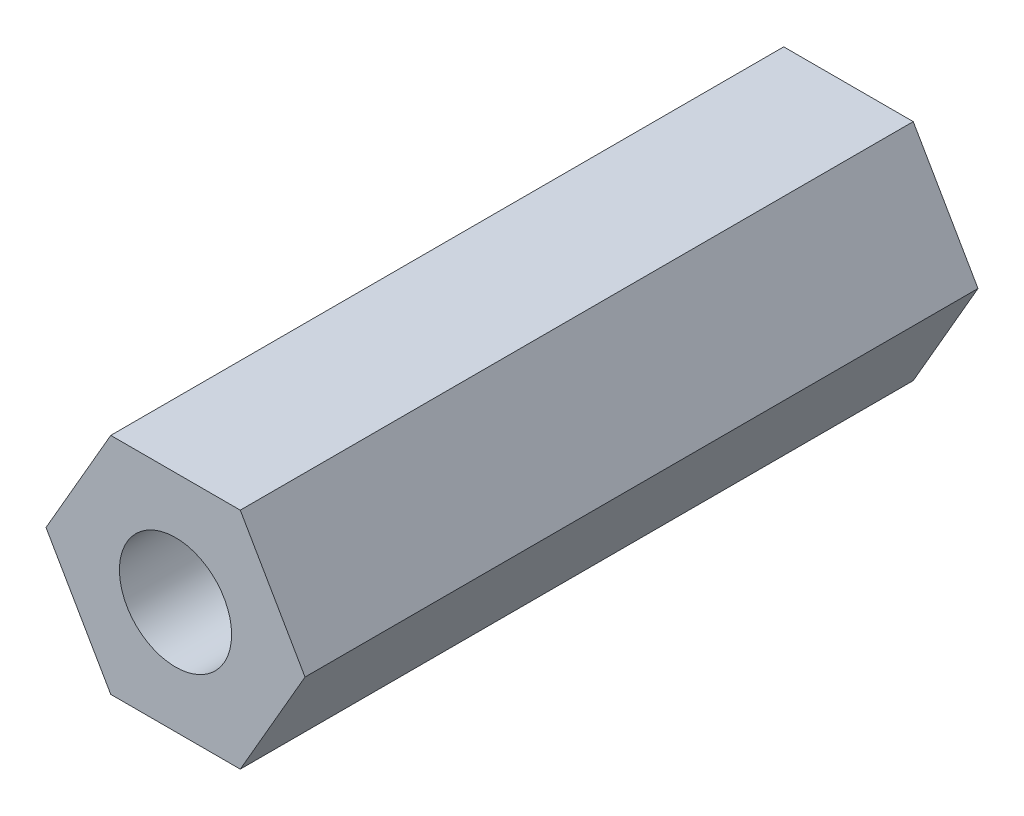
ISO-10303-21;
HEADER;
FILE_DESCRIPTION(('STEP AP214'),'2;1');
FILE_NAME('part.step','',(''),(''),'','','');
FILE_SCHEMA(('AUTOMOTIVE_DESIGN { 1 0 10303 214 1 1 1 1 }'));
ENDSEC;
DATA;
#1=APPLICATION_CONTEXT('core data for automotive mechanical design processes');
#2=APPLICATION_PROTOCOL_DEFINITION('international standard','automotive_design',2000,#1);
#3=PRODUCT_CONTEXT('',#1,'mechanical');
#4=PRODUCT('Part','Part','',(#3));
#5=PRODUCT_RELATED_PRODUCT_CATEGORY('part','',(#4));
#6=PRODUCT_DEFINITION_FORMATION('','',#4);
#7=PRODUCT_DEFINITION_CONTEXT('part definition',#1,'design');
#8=PRODUCT_DEFINITION('design','',#6,#7);
#9=PRODUCT_DEFINITION_SHAPE('','',#8);
#10=(LENGTH_UNIT() NAMED_UNIT(*) SI_UNIT(.MILLI.,.METRE.));
#11=(NAMED_UNIT(*) PLANE_ANGLE_UNIT() SI_UNIT($,.RADIAN.));
#12=(NAMED_UNIT(*) SI_UNIT($,.STERADIAN.) SOLID_ANGLE_UNIT());
#13=UNCERTAINTY_MEASURE_WITH_UNIT(LENGTH_MEASURE(1.E-05),#10,'distance_accuracy_value','');
#14=(GEOMETRIC_REPRESENTATION_CONTEXT(3) GLOBAL_UNCERTAINTY_ASSIGNED_CONTEXT((#13)) GLOBAL_UNIT_ASSIGNED_CONTEXT((#10,
#11,#12)) REPRESENTATION_CONTEXT('',''));
#15=CARTESIAN_POINT('',(0.,0.,0.));
#16=DIRECTION('',(0.,0.,1.));
#17=DIRECTION('',(1.,0.,0.));
#18=AXIS2_PLACEMENT_3D('',#15,#16,#17);
#19=CARTESIAN_POINT('',(2.88675134594813,0.,15.));
#20=DIRECTION('',(-0.866025403784439,-0.5,0.));
#21=DIRECTION('',(0.5,-0.866025403784439,0.));
#22=AXIS2_PLACEMENT_3D('',#19,#20,#21);
#23=PLANE('',#22);
#24=DIRECTION('',(-0.5,0.866025403784439,0.));
#25=VECTOR('',#24,1.);
#26=CARTESIAN_POINT('',(2.88675134594813,0.,0.));
#27=LINE('',#26,#25);
#28=CARTESIAN_POINT('',(2.88675134594813,0.,0.));
#29=VERTEX_POINT('',#28);
#30=CARTESIAN_POINT('',(1.44337567297406,2.5,0.));
#31=VERTEX_POINT('',#30);
#32=EDGE_CURVE('E125',#29,#31,#27,.T.);
#33=ORIENTED_EDGE('',*,*,#32,.T.);
#34=DIRECTION('',(0.,0.,-1.));
#35=VECTOR('',#34,1.);
#36=CARTESIAN_POINT('',(1.44337567297406,2.5,15.));
#37=LINE('',#36,#35);
#38=CARTESIAN_POINT('',(1.44337567297406,2.5,15.));
#39=VERTEX_POINT('',#38);
#40=EDGE_CURVE('E11',#39,#31,#37,.T.);
#41=ORIENTED_EDGE('',*,*,#40,.F.);
#42=DIRECTION('',(-0.5,0.866025403784439,0.));
#43=VECTOR('',#42,1.);
#44=CARTESIAN_POINT('',(2.88675134594813,0.,15.));
#45=LINE('',#44,#43);
#46=CARTESIAN_POINT('',(2.88675134594813,0.,15.));
#47=VERTEX_POINT('',#46);
#48=EDGE_CURVE('E136',#47,#39,#45,.T.);
#49=ORIENTED_EDGE('',*,*,#48,.F.);
#50=DIRECTION('',(0.,0.,-1.));
#51=VECTOR('',#50,1.);
#52=CARTESIAN_POINT('',(2.88675134594813,0.,15.));
#53=LINE('',#52,#51);
#54=EDGE_CURVE('E121',#47,#29,#53,.T.);
#55=ORIENTED_EDGE('',*,*,#54,.T.);
#56=EDGE_LOOP('',(#33,#41,#49,#55));
#57=FACE_BOUND('',#56,.T.);
#58=ADVANCED_FACE('F41',(#57),#23,.F.);
#59=CARTESIAN_POINT('',(1.44337567297406,2.5,15.));
#60=DIRECTION('',(0.,-1.,0.));
#61=DIRECTION('',(0.,0.,-1.));
#62=AXIS2_PLACEMENT_3D('',#59,#60,#61);
#63=PLANE('',#62);
#64=DIRECTION('',(-1.,0.,0.));
#65=VECTOR('',#64,1.);
#66=CARTESIAN_POINT('',(1.44337567297406,2.5,0.));
#67=LINE('',#66,#65);
#68=CARTESIAN_POINT('',(-1.44337567297406,2.5,0.));
#69=VERTEX_POINT('',#68);
#70=EDGE_CURVE('E128',#31,#69,#67,.T.);
#71=ORIENTED_EDGE('',*,*,#70,.T.);
#72=DIRECTION('',(0.,0.,-1.));
#73=VECTOR('',#72,1.);
#74=CARTESIAN_POINT('',(-1.44337567297406,2.5,15.));
#75=LINE('',#74,#73);
#76=CARTESIAN_POINT('',(-1.44337567297406,2.5,15.));
#77=VERTEX_POINT('',#76);
#78=EDGE_CURVE('E49',#77,#69,#75,.T.);
#79=ORIENTED_EDGE('',*,*,#78,.F.);
#80=DIRECTION('',(-1.,0.,0.));
#81=VECTOR('',#80,1.);
#82=CARTESIAN_POINT('',(1.44337567297406,2.5,15.));
#83=LINE('',#82,#81);
#84=EDGE_CURVE('E94',#39,#77,#83,.T.);
#85=ORIENTED_EDGE('',*,*,#84,.F.);
#86=ORIENTED_EDGE('',*,*,#40,.T.);
#87=EDGE_LOOP('',(#71,#79,#85,#86));
#88=FACE_BOUND('',#87,.T.);
#89=ADVANCED_FACE('F161',(#88),#63,.F.);
#90=CARTESIAN_POINT('',(-1.44337567297406,2.5,15.));
#91=DIRECTION('',(0.866025403784439,-0.499999999999999,0.));
#92=DIRECTION('',(0.499999999999999,0.866025403784439,0.));
#93=AXIS2_PLACEMENT_3D('',#90,#91,#92);
#94=PLANE('',#93);
#95=DIRECTION('',(-0.499999999999999,-0.866025403784439,0.));
#96=VECTOR('',#95,1.);
#97=CARTESIAN_POINT('',(-1.44337567297406,2.5,0.));
#98=LINE('',#97,#96);
#99=CARTESIAN_POINT('',(-2.88675134594813,0.,0.));
#100=VERTEX_POINT('',#99);
#101=EDGE_CURVE('E131',#69,#100,#98,.T.);
#102=ORIENTED_EDGE('',*,*,#101,.T.);
#103=DIRECTION('',(0.,0.,-1.));
#104=VECTOR('',#103,1.);
#105=CARTESIAN_POINT('',(-2.88675134594813,0.,15.));
#106=LINE('',#105,#104);
#107=CARTESIAN_POINT('',(-2.88675134594813,0.,15.));
#108=VERTEX_POINT('',#107);
#109=EDGE_CURVE('E116',#108,#100,#106,.T.);
#110=ORIENTED_EDGE('',*,*,#109,.F.);
#111=DIRECTION('',(-0.499999999999999,-0.866025403784439,0.));
#112=VECTOR('',#111,1.);
#113=CARTESIAN_POINT('',(-1.44337567297406,2.5,15.));
#114=LINE('',#113,#112);
#115=EDGE_CURVE('E107',#77,#108,#114,.T.);
#116=ORIENTED_EDGE('',*,*,#115,.F.);
#117=ORIENTED_EDGE('',*,*,#78,.T.);
#118=EDGE_LOOP('',(#102,#110,#116,#117));
#119=FACE_BOUND('',#118,.T.);
#120=ADVANCED_FACE('F142',(#119),#94,.F.);
#121=CARTESIAN_POINT('',(-2.88675134594813,0.,15.));
#122=DIRECTION('',(0.866025403784438,0.5,0.));
#123=DIRECTION('',(-0.5,0.866025403784439,0.));
#124=AXIS2_PLACEMENT_3D('',#121,#122,#123);
#125=PLANE('',#124);
#126=DIRECTION('',(0.5,-0.866025403784438,0.));
#127=VECTOR('',#126,1.);
#128=CARTESIAN_POINT('',(-2.88675134594813,0.,0.));
#129=LINE('',#128,#127);
#130=CARTESIAN_POINT('',(-1.44337567297406,-2.5,0.));
#131=VERTEX_POINT('',#130);
#132=EDGE_CURVE('E115',#100,#131,#129,.T.);
#133=ORIENTED_EDGE('',*,*,#132,.T.);
#134=DIRECTION('',(0.,0.,-1.));
#135=VECTOR('',#134,1.);
#136=CARTESIAN_POINT('',(-1.44337567297406,-2.5,15.));
#137=LINE('',#136,#135);
#138=CARTESIAN_POINT('',(-1.44337567297406,-2.5,15.));
#139=VERTEX_POINT('',#138);
#140=EDGE_CURVE('E112',#139,#131,#137,.T.);
#141=ORIENTED_EDGE('',*,*,#140,.F.);
#142=DIRECTION('',(0.5,-0.866025403784438,0.));
#143=VECTOR('',#142,1.);
#144=CARTESIAN_POINT('',(-2.88675134594813,0.,15.));
#145=LINE('',#144,#143);
#146=EDGE_CURVE('E101',#108,#139,#145,.T.);
#147=ORIENTED_EDGE('',*,*,#146,.F.);
#148=ORIENTED_EDGE('',*,*,#109,.T.);
#149=EDGE_LOOP('',(#133,#141,#147,#148));
#150=FACE_BOUND('',#149,.T.);
#151=ADVANCED_FACE('F113',(#150),#125,.F.);
#152=CARTESIAN_POINT('',(-1.44337567297406,-2.5,15.));
#153=DIRECTION('',(0.,1.,0.));
#154=DIRECTION('',(-1.,0.,0.));
#155=AXIS2_PLACEMENT_3D('',#152,#153,#154);
#156=PLANE('',#155);
#157=DIRECTION('',(1.,0.,0.));
#158=VECTOR('',#157,1.);
#159=CARTESIAN_POINT('',(-1.44337567297406,-2.5,0.));
#160=LINE('',#159,#158);
#161=CARTESIAN_POINT('',(1.44337567297407,-2.5,0.));
#162=VERTEX_POINT('',#161);
#163=EDGE_CURVE('E80',#131,#162,#160,.T.);
#164=ORIENTED_EDGE('',*,*,#163,.T.);
#165=DIRECTION('',(0.,0.,-1.));
#166=VECTOR('',#165,1.);
#167=CARTESIAN_POINT('',(1.44337567297407,-2.5,15.));
#168=LINE('',#167,#166);
#169=CARTESIAN_POINT('',(1.44337567297407,-2.5,15.));
#170=VERTEX_POINT('',#169);
#171=EDGE_CURVE('E117',#170,#162,#168,.T.);
#172=ORIENTED_EDGE('',*,*,#171,.F.);
#173=DIRECTION('',(1.,0.,0.));
#174=VECTOR('',#173,1.);
#175=CARTESIAN_POINT('',(-1.44337567297406,-2.5,15.));
#176=LINE('',#175,#174);
#177=EDGE_CURVE('E105',#139,#170,#176,.T.);
#178=ORIENTED_EDGE('',*,*,#177,.F.);
#179=ORIENTED_EDGE('',*,*,#140,.T.);
#180=EDGE_LOOP('',(#164,#172,#178,#179));
#181=FACE_BOUND('',#180,.T.);
#182=ADVANCED_FACE('F119',(#181),#156,.F.);
#183=CARTESIAN_POINT('',(1.44337567297407,-2.5,15.));
#184=DIRECTION('',(-0.866025403784439,0.5,0.));
#185=DIRECTION('',(-0.5,-0.866025403784439,0.));
#186=AXIS2_PLACEMENT_3D('',#183,#184,#185);
#187=PLANE('',#186);
#188=DIRECTION('',(0.5,0.866025403784439,0.));
#189=VECTOR('',#188,1.);
#190=CARTESIAN_POINT('',(1.44337567297407,-2.5,0.));
#191=LINE('',#190,#189);
#192=EDGE_CURVE('E86',#162,#29,#191,.T.);
#193=ORIENTED_EDGE('',*,*,#192,.T.);
#194=ORIENTED_EDGE('',*,*,#54,.F.);
#195=DIRECTION('',(0.5,0.866025403784439,0.));
#196=VECTOR('',#195,1.);
#197=CARTESIAN_POINT('',(1.44337567297407,-2.5,15.));
#198=LINE('',#197,#196);
#199=EDGE_CURVE('E57',#170,#47,#198,.T.);
#200=ORIENTED_EDGE('',*,*,#199,.F.);
#201=ORIENTED_EDGE('',*,*,#171,.T.);
#202=EDGE_LOOP('',(#193,#194,#200,#201));
#203=FACE_BOUND('',#202,.T.);
#204=ADVANCED_FACE('F149',(#203),#187,.F.);
#205=CARTESIAN_POINT('',(0.,0.,15.));
#206=DIRECTION('',(0.,0.,1.));
#207=DIRECTION('',(1.,0.,0.));
#208=AXIS2_PLACEMENT_3D('',#205,#206,#207);
#209=PLANE('',#208);
#210=CARTESIAN_POINT('',(0.,0.,15.));
#211=DIRECTION('',(0.,0.,1.));
#212=DIRECTION('',(1.,0.,0.));
#213=AXIS2_PLACEMENT_3D('',#210,#211,#212);
#214=CIRCLE('',#213,1.25);
#215=CARTESIAN_POINT('',(1.25,0.,15.));
#216=VERTEX_POINT('',#215);
#217=EDGE_CURVE('E218',#216,#216,#214,.T.);
#218=ORIENTED_EDGE('',*,*,#217,.F.);
#219=EDGE_LOOP('',(#218));
#220=FACE_BOUND('',#219,.T.);
#221=ORIENTED_EDGE('',*,*,#48,.T.);
#222=ORIENTED_EDGE('',*,*,#84,.T.);
#223=ORIENTED_EDGE('',*,*,#115,.T.);
#224=ORIENTED_EDGE('',*,*,#146,.T.);
#225=ORIENTED_EDGE('',*,*,#177,.T.);
#226=ORIENTED_EDGE('',*,*,#199,.T.);
#227=EDGE_LOOP('',(#221,#222,#223,#224,#225,#226));
#228=FACE_BOUND('',#227,.T.);
#229=ADVANCED_FACE('F103',(#220,#228),#209,.T.);
#230=CARTESIAN_POINT('',(0.,0.,0.));
#231=DIRECTION('',(0.,0.,1.));
#232=DIRECTION('',(1.,0.,0.));
#233=AXIS2_PLACEMENT_3D('',#230,#231,#232);
#234=PLANE('',#233);
#235=CARTESIAN_POINT('',(0.,0.,0.));
#236=DIRECTION('',(0.,0.,1.));
#237=DIRECTION('',(1.,0.,0.));
#238=AXIS2_PLACEMENT_3D('',#235,#236,#237);
#239=CIRCLE('',#238,1.25);
#240=CARTESIAN_POINT('',(1.25,0.,0.));
#241=VERTEX_POINT('',#240);
#242=EDGE_CURVE('E129',#241,#241,#239,.T.);
#243=ORIENTED_EDGE('',*,*,#242,.T.);
#244=EDGE_LOOP('',(#243));
#245=FACE_BOUND('',#244,.T.);
#246=ORIENTED_EDGE('',*,*,#32,.F.);
#247=ORIENTED_EDGE('',*,*,#192,.F.);
#248=ORIENTED_EDGE('',*,*,#163,.F.);
#249=ORIENTED_EDGE('',*,*,#132,.F.);
#250=ORIENTED_EDGE('',*,*,#101,.F.);
#251=ORIENTED_EDGE('',*,*,#70,.F.);
#252=EDGE_LOOP('',(#246,#247,#248,#249,#250,#251));
#253=FACE_BOUND('',#252,.T.);
#254=ADVANCED_FACE('F145',(#245,#253),#234,.F.);
#255=CARTESIAN_POINT('',(0.,0.,15.));
#256=DIRECTION('',(0.,0.,1.));
#257=DIRECTION('',(1.,0.,0.));
#258=AXIS2_PLACEMENT_3D('',#255,#256,#257);
#259=CYLINDRICAL_SURFACE('',#258,1.25);
#260=ORIENTED_EDGE('',*,*,#242,.F.);
#261=EDGE_LOOP('',(#260));
#262=FACE_BOUND('',#261,.T.);
#263=ORIENTED_EDGE('',*,*,#217,.T.);
#264=EDGE_LOOP('',(#263));
#265=FACE_BOUND('',#264,.T.);
#266=ADVANCED_FACE('F198',(#262,#265),#259,.F.);
#267=CLOSED_SHELL('',(#58,#89,#120,#151,#182,#204,#229,#254,#266));
#268=MANIFOLD_SOLID_BREP('B2',#267);
#269=ADVANCED_BREP_SHAPE_REPRESENTATION('',(#18,#268),#14);
#270=SHAPE_DEFINITION_REPRESENTATION(#9,#269);
ENDSEC;
END-ISO-10303-21;
